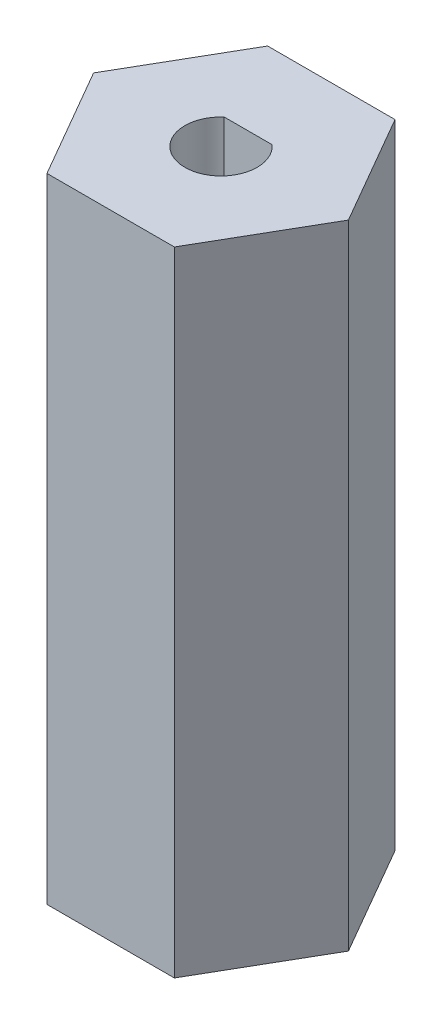
ISO-10303-21;
HEADER;
FILE_DESCRIPTION(('STEP AP214'),'2;1');
FILE_NAME('part.step','',(''),(''),'','','');
FILE_SCHEMA(('AUTOMOTIVE_DESIGN { 1 0 10303 214 1 1 1 1 }'));
ENDSEC;
DATA;
#1=APPLICATION_CONTEXT('core data for automotive mechanical design processes');
#2=APPLICATION_PROTOCOL_DEFINITION('international standard','automotive_design',2000,#1);
#3=PRODUCT_CONTEXT('',#1,'mechanical');
#4=PRODUCT('Part','Part','',(#3));
#5=PRODUCT_RELATED_PRODUCT_CATEGORY('part','',(#4));
#6=PRODUCT_DEFINITION_FORMATION('','',#4);
#7=PRODUCT_DEFINITION_CONTEXT('part definition',#1,'design');
#8=PRODUCT_DEFINITION('design','',#6,#7);
#9=PRODUCT_DEFINITION_SHAPE('','',#8);
#10=(LENGTH_UNIT() NAMED_UNIT(*) SI_UNIT(.MILLI.,.METRE.));
#11=(NAMED_UNIT(*) PLANE_ANGLE_UNIT() SI_UNIT($,.RADIAN.));
#12=(NAMED_UNIT(*) SI_UNIT($,.STERADIAN.) SOLID_ANGLE_UNIT());
#13=UNCERTAINTY_MEASURE_WITH_UNIT(LENGTH_MEASURE(1.E-05),#10,'distance_accuracy_value','');
#14=(GEOMETRIC_REPRESENTATION_CONTEXT(3) GLOBAL_UNCERTAINTY_ASSIGNED_CONTEXT((#13)) GLOBAL_UNIT_ASSIGNED_CONTEXT((#10,
#11,#12)) REPRESENTATION_CONTEXT('',''));
#15=CARTESIAN_POINT('',(0.,0.,0.));
#16=DIRECTION('',(0.,0.,1.));
#17=DIRECTION('',(1.,0.,0.));
#18=AXIS2_PLACEMENT_3D('',#15,#16,#17);
#19=CARTESIAN_POINT('',(7.04367328411344,35.,0.));
#20=DIRECTION('',(-0.866025403784439,0.,0.5));
#21=DIRECTION('',(0.5,0.,0.866025403784439));
#22=AXIS2_PLACEMENT_3D('',#19,#20,#21);
#23=PLANE('',#22);
#24=DIRECTION('',(-0.5,0.,-0.866025403784439));
#25=VECTOR('',#24,1.);
#26=CARTESIAN_POINT('',(7.04367328411344,0.,0.));
#27=LINE('',#26,#25);
#28=CARTESIAN_POINT('',(7.04367328411344,0.,0.));
#29=VERTEX_POINT('',#28);
#30=CARTESIAN_POINT('',(3.52183664205672,0.,-6.1));
#31=VERTEX_POINT('',#30);
#32=EDGE_CURVE('E144',#29,#31,#27,.T.);
#33=ORIENTED_EDGE('',*,*,#32,.T.);
#34=DIRECTION('',(0.,-1.,0.));
#35=VECTOR('',#34,1.);
#36=CARTESIAN_POINT('',(3.52183664205672,35.,-6.1));
#37=LINE('',#36,#35);
#38=CARTESIAN_POINT('',(3.52183664205672,35.,-6.1));
#39=VERTEX_POINT('',#38);
#40=EDGE_CURVE('E11',#39,#31,#37,.T.);
#41=ORIENTED_EDGE('',*,*,#40,.F.);
#42=DIRECTION('',(-0.5,0.,-0.866025403784439));
#43=VECTOR('',#42,1.);
#44=CARTESIAN_POINT('',(7.04367328411344,35.,0.));
#45=LINE('',#44,#43);
#46=CARTESIAN_POINT('',(7.04367328411344,35.,0.));
#47=VERTEX_POINT('',#46);
#48=EDGE_CURVE('E162',#47,#39,#45,.T.);
#49=ORIENTED_EDGE('',*,*,#48,.F.);
#50=DIRECTION('',(0.,-1.,0.));
#51=VECTOR('',#50,1.);
#52=CARTESIAN_POINT('',(7.04367328411344,35.,0.));
#53=LINE('',#52,#51);
#54=EDGE_CURVE('E140',#47,#29,#53,.T.);
#55=ORIENTED_EDGE('',*,*,#54,.T.);
#56=EDGE_LOOP('',(#33,#41,#49,#55));
#57=FACE_BOUND('',#56,.T.);
#58=ADVANCED_FACE('F43',(#57),#23,.F.);
#59=CARTESIAN_POINT('',(3.52183664205672,35.,-6.1));
#60=DIRECTION('',(0.,0.,1.));
#61=DIRECTION('',(1.,0.,0.));
#62=AXIS2_PLACEMENT_3D('',#59,#60,#61);
#63=PLANE('',#62);
#64=DIRECTION('',(-1.,0.,0.));
#65=VECTOR('',#64,1.);
#66=CARTESIAN_POINT('',(3.52183664205672,0.,-6.1));
#67=LINE('',#66,#65);
#68=CARTESIAN_POINT('',(-3.52183664205672,0.,-6.1));
#69=VERTEX_POINT('',#68);
#70=EDGE_CURVE('E148',#31,#69,#67,.T.);
#71=ORIENTED_EDGE('',*,*,#70,.T.);
#72=DIRECTION('',(0.,-1.,0.));
#73=VECTOR('',#72,1.);
#74=CARTESIAN_POINT('',(-3.52183664205672,35.,-6.1));
#75=LINE('',#74,#73);
#76=CARTESIAN_POINT('',(-3.52183664205672,35.,-6.1));
#77=VERTEX_POINT('',#76);
#78=EDGE_CURVE('E51',#77,#69,#75,.T.);
#79=ORIENTED_EDGE('',*,*,#78,.F.);
#80=DIRECTION('',(-1.,0.,0.));
#81=VECTOR('',#80,1.);
#82=CARTESIAN_POINT('',(3.52183664205672,35.,-6.1));
#83=LINE('',#82,#81);
#84=EDGE_CURVE('E102',#39,#77,#83,.T.);
#85=ORIENTED_EDGE('',*,*,#84,.F.);
#86=ORIENTED_EDGE('',*,*,#40,.T.);
#87=EDGE_LOOP('',(#71,#79,#85,#86));
#88=FACE_BOUND('',#87,.T.);
#89=ADVANCED_FACE('F230',(#88),#63,.F.);
#90=CARTESIAN_POINT('',(-3.52183664205672,35.,-6.1));
#91=DIRECTION('',(0.866025403784439,0.,0.5));
#92=DIRECTION('',(0.5,0.,-0.866025403784439));
#93=AXIS2_PLACEMENT_3D('',#90,#91,#92);
#94=PLANE('',#93);
#95=DIRECTION('',(-0.5,0.,0.866025403784439));
#96=VECTOR('',#95,1.);
#97=CARTESIAN_POINT('',(-3.52183664205672,0.,-6.1));
#98=LINE('',#97,#96);
#99=CARTESIAN_POINT('',(-7.04367328411343,0.,0.));
#100=VERTEX_POINT('',#99);
#101=EDGE_CURVE('E152',#69,#100,#98,.T.);
#102=ORIENTED_EDGE('',*,*,#101,.T.);
#103=DIRECTION('',(0.,-1.,0.));
#104=VECTOR('',#103,1.);
#105=CARTESIAN_POINT('',(-7.04367328411343,35.,0.));
#106=LINE('',#105,#104);
#107=CARTESIAN_POINT('',(-7.04367328411343,35.,0.));
#108=VERTEX_POINT('',#107);
#109=EDGE_CURVE('E133',#108,#100,#106,.T.);
#110=ORIENTED_EDGE('',*,*,#109,.F.);
#111=DIRECTION('',(-0.5,0.,0.866025403784439));
#112=VECTOR('',#111,1.);
#113=CARTESIAN_POINT('',(-3.52183664205672,35.,-6.1));
#114=LINE('',#113,#112);
#115=EDGE_CURVE('E119',#77,#108,#114,.T.);
#116=ORIENTED_EDGE('',*,*,#115,.F.);
#117=ORIENTED_EDGE('',*,*,#78,.T.);
#118=EDGE_LOOP('',(#102,#110,#116,#117));
#119=FACE_BOUND('',#118,.T.);
#120=ADVANCED_FACE('F172',(#119),#94,.F.);
#121=CARTESIAN_POINT('',(-7.04367328411343,35.,0.));
#122=DIRECTION('',(0.866025403784439,0.,-0.5));
#123=DIRECTION('',(-0.5,0.,-0.866025403784439));
#124=AXIS2_PLACEMENT_3D('',#121,#122,#123);
#125=PLANE('',#124);
#126=DIRECTION('',(0.5,0.,0.866025403784438));
#127=VECTOR('',#126,1.);
#128=CARTESIAN_POINT('',(-7.04367328411343,0.,0.));
#129=LINE('',#128,#127);
#130=CARTESIAN_POINT('',(-3.52183664205671,0.,6.1));
#131=VERTEX_POINT('',#130);
#132=EDGE_CURVE('E129',#100,#131,#129,.T.);
#133=ORIENTED_EDGE('',*,*,#132,.T.);
#134=DIRECTION('',(0.,-1.,0.));
#135=VECTOR('',#134,1.);
#136=CARTESIAN_POINT('',(-3.52183664205671,35.,6.1));
#137=LINE('',#136,#135);
#138=CARTESIAN_POINT('',(-3.52183664205671,35.,6.1));
#139=VERTEX_POINT('',#138);
#140=EDGE_CURVE('E126',#139,#131,#137,.T.);
#141=ORIENTED_EDGE('',*,*,#140,.F.);
#142=DIRECTION('',(0.5,0.,0.866025403784438));
#143=VECTOR('',#142,1.);
#144=CARTESIAN_POINT('',(-7.04367328411343,35.,0.));
#145=LINE('',#144,#143);
#146=EDGE_CURVE('E112',#108,#139,#145,.T.);
#147=ORIENTED_EDGE('',*,*,#146,.F.);
#148=ORIENTED_EDGE('',*,*,#109,.T.);
#149=EDGE_LOOP('',(#133,#141,#147,#148));
#150=FACE_BOUND('',#149,.T.);
#151=ADVANCED_FACE('F127',(#150),#125,.F.);
#152=CARTESIAN_POINT('',(-3.52183664205671,35.,6.1));
#153=DIRECTION('',(0.,0.,-1.));
#154=DIRECTION('',(-1.,0.,0.));
#155=AXIS2_PLACEMENT_3D('',#152,#153,#154);
#156=PLANE('',#155);
#157=DIRECTION('',(1.,0.,0.));
#158=VECTOR('',#157,1.);
#159=CARTESIAN_POINT('',(-3.52183664205671,0.,6.1));
#160=LINE('',#159,#158);
#161=CARTESIAN_POINT('',(3.52183664205672,0.,6.1));
#162=VERTEX_POINT('',#161);
#163=EDGE_CURVE('E157',#131,#162,#160,.T.);
#164=ORIENTED_EDGE('',*,*,#163,.T.);
#165=DIRECTION('',(0.,-1.,0.));
#166=VECTOR('',#165,1.);
#167=CARTESIAN_POINT('',(3.52183664205672,35.,6.1));
#168=LINE('',#167,#166);
#169=CARTESIAN_POINT('',(3.52183664205672,35.,6.1));
#170=VERTEX_POINT('',#169);
#171=EDGE_CURVE('E134',#170,#162,#168,.T.);
#172=ORIENTED_EDGE('',*,*,#171,.F.);
#173=DIRECTION('',(1.,0.,0.));
#174=VECTOR('',#173,1.);
#175=CARTESIAN_POINT('',(-3.52183664205671,35.,6.1));
#176=LINE('',#175,#174);
#177=EDGE_CURVE('E116',#139,#170,#176,.T.);
#178=ORIENTED_EDGE('',*,*,#177,.F.);
#179=ORIENTED_EDGE('',*,*,#140,.T.);
#180=EDGE_LOOP('',(#164,#172,#178,#179));
#181=FACE_BOUND('',#180,.T.);
#182=ADVANCED_FACE('F136',(#181),#156,.F.);
#183=CARTESIAN_POINT('',(3.52183664205672,35.,6.1));
#184=DIRECTION('',(-0.866025403784439,0.,-0.5));
#185=DIRECTION('',(-0.5,0.,0.866025403784439));
#186=AXIS2_PLACEMENT_3D('',#183,#184,#185);
#187=PLANE('',#186);
#188=DIRECTION('',(0.5,0.,-0.866025403784439));
#189=VECTOR('',#188,1.);
#190=CARTESIAN_POINT('',(3.52183664205672,0.,6.1));
#191=LINE('',#190,#189);
#192=EDGE_CURVE('E94',#162,#29,#191,.T.);
#193=ORIENTED_EDGE('',*,*,#192,.T.);
#194=ORIENTED_EDGE('',*,*,#54,.F.);
#195=DIRECTION('',(0.5,0.,-0.866025403784439));
#196=VECTOR('',#195,1.);
#197=CARTESIAN_POINT('',(3.52183664205672,35.,6.1));
#198=LINE('',#197,#196);
#199=EDGE_CURVE('E67',#170,#47,#198,.T.);
#200=ORIENTED_EDGE('',*,*,#199,.F.);
#201=ORIENTED_EDGE('',*,*,#171,.T.);
#202=EDGE_LOOP('',(#193,#194,#200,#201));
#203=FACE_BOUND('',#202,.T.);
#204=ADVANCED_FACE('F176',(#203),#187,.F.);
#205=CARTESIAN_POINT('',(0.,35.,0.));
#206=DIRECTION('',(0.,1.,0.));
#207=DIRECTION('',(0.,0.,1.));
#208=AXIS2_PLACEMENT_3D('',#205,#206,#207);
#209=PLANE('',#208);
#210=DIRECTION('',(-1.,0.,0.));
#211=VECTOR('',#210,1.);
#212=CARTESIAN_POINT('',(-1.3228756555323,35.,-1.5));
#213=LINE('',#212,#211);
#214=CARTESIAN_POINT('',(1.3228756555323,35.,-1.5));
#215=VERTEX_POINT('',#214);
#216=CARTESIAN_POINT('',(-1.3228756555323,35.,-1.5));
#217=VERTEX_POINT('',#216);
#218=EDGE_CURVE('E58',#215,#217,#213,.T.);
#219=ORIENTED_EDGE('',*,*,#218,.F.);
#220=CARTESIAN_POINT('',(0.,35.,0.));
#221=DIRECTION('',(0.,1.,0.));
#222=DIRECTION('',(0.,0.,1.));
#223=AXIS2_PLACEMENT_3D('',#220,#221,#222);
#224=CIRCLE('',#223,2.);
#225=EDGE_CURVE('E207',#217,#215,#224,.T.);
#226=ORIENTED_EDGE('',*,*,#225,.F.);
#227=EDGE_LOOP('',(#219,#226));
#228=FACE_BOUND('',#227,.T.);
#229=ORIENTED_EDGE('',*,*,#48,.T.);
#230=ORIENTED_EDGE('',*,*,#84,.T.);
#231=ORIENTED_EDGE('',*,*,#115,.T.);
#232=ORIENTED_EDGE('',*,*,#146,.T.);
#233=ORIENTED_EDGE('',*,*,#177,.T.);
#234=ORIENTED_EDGE('',*,*,#199,.T.);
#235=EDGE_LOOP('',(#229,#230,#231,#232,#233,#234));
#236=FACE_BOUND('',#235,.T.);
#237=ADVANCED_FACE('F114',(#228,#236),#209,.T.);
#238=CARTESIAN_POINT('',(0.,0.,0.));
#239=DIRECTION('',(0.,1.,0.));
#240=DIRECTION('',(0.,0.,1.));
#241=AXIS2_PLACEMENT_3D('',#238,#239,#240);
#242=PLANE('',#241);
#243=CARTESIAN_POINT('',(0.,0.,0.));
#244=DIRECTION('',(0.,-1.,0.));
#245=DIRECTION('',(0.,0.,-1.));
#246=AXIS2_PLACEMENT_3D('',#243,#244,#245);
#247=CIRCLE('',#246,1.27);
#248=CARTESIAN_POINT('',(0.,0.,-1.27));
#249=VERTEX_POINT('',#248);
#250=EDGE_CURVE('E149',#249,#249,#247,.T.);
#251=ORIENTED_EDGE('',*,*,#250,.F.);
#252=EDGE_LOOP('',(#251));
#253=FACE_BOUND('',#252,.T.);
#254=ORIENTED_EDGE('',*,*,#32,.F.);
#255=ORIENTED_EDGE('',*,*,#192,.F.);
#256=ORIENTED_EDGE('',*,*,#163,.F.);
#257=ORIENTED_EDGE('',*,*,#132,.F.);
#258=ORIENTED_EDGE('',*,*,#101,.F.);
#259=ORIENTED_EDGE('',*,*,#70,.F.);
#260=EDGE_LOOP('',(#254,#255,#256,#257,#258,#259));
#261=FACE_BOUND('',#260,.T.);
#262=ADVANCED_FACE('F175',(#253,#261),#242,.F.);
#263=CARTESIAN_POINT('',(0.,21.,0.));
#264=DIRECTION('',(0.,-1.,0.));
#265=DIRECTION('',(0.,0.,-1.));
#266=AXIS2_PLACEMENT_3D('',#263,#264,#265);
#267=CYLINDRICAL_SURFACE('',#266,1.27);
#268=CARTESIAN_POINT('',(0.,21.,0.));
#269=DIRECTION('',(0.,-1.,0.));
#270=DIRECTION('',(0.,0.,-1.));
#271=AXIS2_PLACEMENT_3D('',#268,#269,#270);
#272=CIRCLE('',#271,1.27);
#273=CARTESIAN_POINT('',(0.,21.,-1.27));
#274=VERTEX_POINT('',#273);
#275=EDGE_CURVE('E189',#274,#274,#272,.T.);
#276=ORIENTED_EDGE('',*,*,#275,.F.);
#277=EDGE_LOOP('',(#276));
#278=FACE_BOUND('',#277,.T.);
#279=ORIENTED_EDGE('',*,*,#250,.T.);
#280=EDGE_LOOP('',(#279));
#281=FACE_BOUND('',#280,.T.);
#282=ADVANCED_FACE('F224',(#278,#281),#267,.F.);
#283=CARTESIAN_POINT('',(0.,21.,0.));
#284=DIRECTION('',(0.,-1.,0.));
#285=DIRECTION('',(0.,0.,-1.));
#286=AXIS2_PLACEMENT_3D('',#283,#284,#285);
#287=PLANE('',#286);
#288=ORIENTED_EDGE('',*,*,#275,.T.);
#289=EDGE_LOOP('',(#288));
#290=FACE_BOUND('',#289,.T.);
#291=CARTESIAN_POINT('',(0.,21.,0.));
#292=DIRECTION('',(0.,-1.,0.));
#293=DIRECTION('',(0.,0.,-1.));
#294=AXIS2_PLACEMENT_3D('',#291,#292,#293);
#295=CIRCLE('',#294,2.);
#296=CARTESIAN_POINT('',(-1.3228756555323,21.,-1.5));
#297=VERTEX_POINT('',#296);
#298=CARTESIAN_POINT('',(1.3228756555323,21.,-1.5));
#299=VERTEX_POINT('',#298);
#300=EDGE_CURVE('E196',#297,#299,#295,.F.);
#301=ORIENTED_EDGE('',*,*,#300,.T.);
#302=DIRECTION('',(-1.,0.,0.));
#303=VECTOR('',#302,1.);
#304=CARTESIAN_POINT('',(-1.3228756555323,21.,-1.5));
#305=LINE('',#304,#303);
#306=EDGE_CURVE('E200',#299,#297,#305,.T.);
#307=ORIENTED_EDGE('',*,*,#306,.T.);
#308=EDGE_LOOP('',(#301,#307));
#309=FACE_BOUND('',#308,.T.);
#310=ADVANCED_FACE('F267',(#290,#309),#287,.F.);
#311=CARTESIAN_POINT('',(-1.3228756555323,15.6849270936327,-1.5));
#312=DIRECTION('',(0.,0.,-1.));
#313=DIRECTION('',(-1.,0.,0.));
#314=AXIS2_PLACEMENT_3D('',#311,#312,#313);
#315=PLANE('',#314);
#316=DIRECTION('',(0.,1.,0.));
#317=VECTOR('',#316,1.);
#318=CARTESIAN_POINT('',(1.3228756555323,15.6849270936327,-1.5));
#319=LINE('',#318,#317);
#320=EDGE_CURVE('E193',#299,#215,#319,.T.);
#321=ORIENTED_EDGE('',*,*,#320,.T.);
#322=ORIENTED_EDGE('',*,*,#218,.T.);
#323=DIRECTION('',(0.,1.,0.));
#324=VECTOR('',#323,1.);
#325=CARTESIAN_POINT('',(-1.3228756555323,15.6849270936327,-1.5));
#326=LINE('',#325,#324);
#327=EDGE_CURVE('E197',#297,#217,#326,.T.);
#328=ORIENTED_EDGE('',*,*,#327,.F.);
#329=ORIENTED_EDGE('',*,*,#306,.F.);
#330=EDGE_LOOP('',(#321,#322,#328,#329));
#331=FACE_BOUND('',#330,.T.);
#332=ADVANCED_FACE('F282',(#331),#315,.F.);
#333=CARTESIAN_POINT('',(0.,15.6849270936327,0.));
#334=DIRECTION('',(0.,1.,0.));
#335=DIRECTION('',(0.,0.,1.));
#336=AXIS2_PLACEMENT_3D('',#333,#334,#335);
#337=CYLINDRICAL_SURFACE('',#336,2.);
#338=ORIENTED_EDGE('',*,*,#327,.T.);
#339=ORIENTED_EDGE('',*,*,#225,.T.);
#340=ORIENTED_EDGE('',*,*,#320,.F.);
#341=ORIENTED_EDGE('',*,*,#300,.F.);
#342=EDGE_LOOP('',(#338,#339,#340,#341));
#343=FACE_BOUND('',#342,.T.);
#344=ADVANCED_FACE('F215',(#343),#337,.F.);
#345=CLOSED_SHELL('',(#58,#89,#120,#151,#182,#204,#237,#262,#282,#310,#332,#344));
#346=MANIFOLD_SOLID_BREP('B2',#345);
#347=ADVANCED_BREP_SHAPE_REPRESENTATION('',(#18,#346),#14);
#348=SHAPE_DEFINITION_REPRESENTATION(#9,#347);
ENDSEC;
END-ISO-10303-21;
